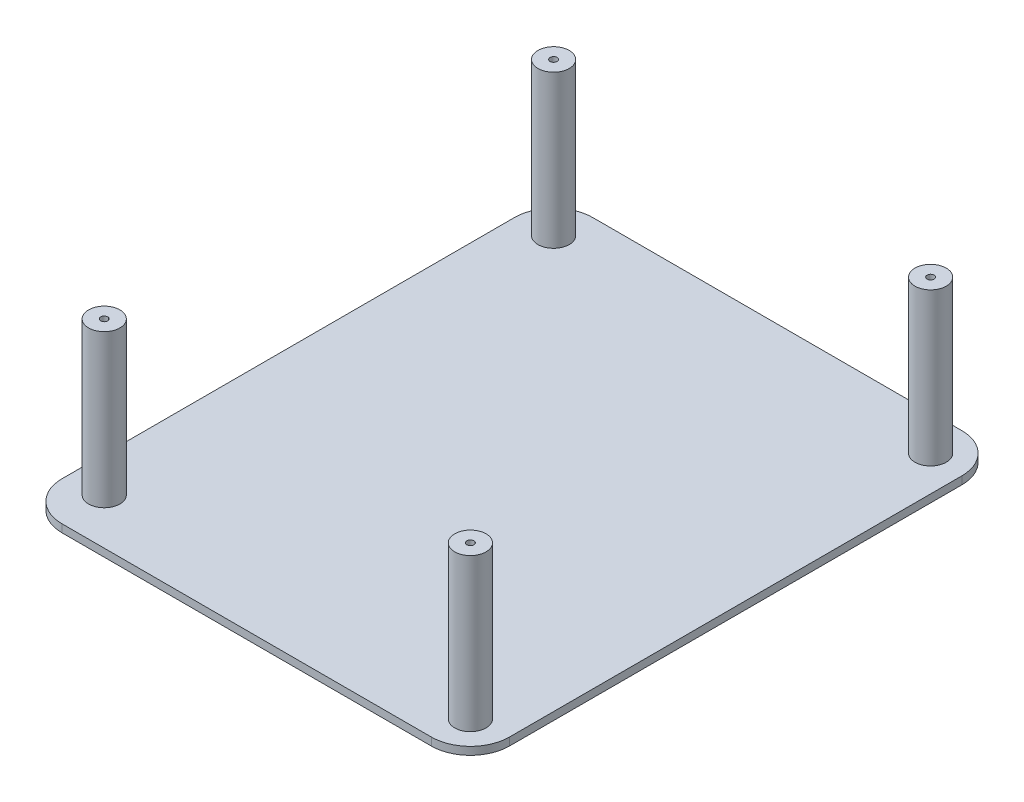
ISO-10303-21;
HEADER;
FILE_DESCRIPTION(('STEP AP214'),'2;1');
FILE_NAME('part.step','',(''),(''),'','','');
FILE_SCHEMA(('AUTOMOTIVE_DESIGN { 1 0 10303 214 1 1 1 1 }'));
ENDSEC;
DATA;
#1=APPLICATION_CONTEXT('core data for automotive mechanical design processes');
#2=APPLICATION_PROTOCOL_DEFINITION('international standard','automotive_design',2000,#1);
#3=PRODUCT_CONTEXT('',#1,'mechanical');
#4=PRODUCT('Part','Part','',(#3));
#5=PRODUCT_RELATED_PRODUCT_CATEGORY('part','',(#4));
#6=PRODUCT_DEFINITION_FORMATION('','',#4);
#7=PRODUCT_DEFINITION_CONTEXT('part definition',#1,'design');
#8=PRODUCT_DEFINITION('design','',#6,#7);
#9=PRODUCT_DEFINITION_SHAPE('','',#8);
#10=(LENGTH_UNIT() NAMED_UNIT(*) SI_UNIT(.MILLI.,.METRE.));
#11=(NAMED_UNIT(*) PLANE_ANGLE_UNIT() SI_UNIT($,.RADIAN.));
#12=(NAMED_UNIT(*) SI_UNIT($,.STERADIAN.) SOLID_ANGLE_UNIT());
#13=UNCERTAINTY_MEASURE_WITH_UNIT(LENGTH_MEASURE(1.E-05),#10,'distance_accuracy_value','');
#14=(GEOMETRIC_REPRESENTATION_CONTEXT(3) GLOBAL_UNCERTAINTY_ASSIGNED_CONTEXT((#13)) GLOBAL_UNIT_ASSIGNED_CONTEXT((#10,
#11,#12)) REPRESENTATION_CONTEXT('',''));
#15=CARTESIAN_POINT('',(0.,0.,0.));
#16=DIRECTION('',(0.,0.,1.));
#17=DIRECTION('',(1.,0.,0.));
#18=AXIS2_PLACEMENT_3D('',#15,#16,#17);
#19=CARTESIAN_POINT('',(-57.434954554311,2.,-52.5896188820338));
#20=DIRECTION('',(1.,0.,0.));
#21=DIRECTION('',(0.,0.,-1.));
#22=AXIS2_PLACEMENT_3D('',#19,#20,#21);
#23=PLANE('',#22);
#24=DIRECTION('',(0.,0.,1.));
#25=VECTOR('',#24,1.);
#26=CARTESIAN_POINT('',(-57.434954554311,0.,-52.5896188820338));
#27=LINE('',#26,#25);
#28=CARTESIAN_POINT('',(-57.434954554311,0.,-42.5896188820338));
#29=VERTEX_POINT('',#28);
#30=CARTESIAN_POINT('',(-57.434954554311,0.,73.0797799417298));
#31=VERTEX_POINT('',#30);
#32=EDGE_CURVE('E136',#29,#31,#27,.T.);
#33=ORIENTED_EDGE('',*,*,#32,.T.);
#34=DIRECTION('',(0.,-1.,0.));
#35=VECTOR('',#34,1.);
#36=CARTESIAN_POINT('',(-57.434954554311,2.,73.0797799417298));
#37=LINE('',#36,#35);
#38=CARTESIAN_POINT('',(-57.434954554311,2.,73.0797799417298));
#39=VERTEX_POINT('',#38);
#40=EDGE_CURVE('E111',#31,#39,#37,.F.);
#41=ORIENTED_EDGE('',*,*,#40,.T.);
#42=DIRECTION('',(0.,0.,1.));
#43=VECTOR('',#42,1.);
#44=CARTESIAN_POINT('',(-57.434954554311,2.,-52.5896188820338));
#45=LINE('',#44,#43);
#46=CARTESIAN_POINT('',(-57.434954554311,2.,-42.5896188820338));
#47=VERTEX_POINT('',#46);
#48=EDGE_CURVE('E149',#47,#39,#45,.T.);
#49=ORIENTED_EDGE('',*,*,#48,.F.);
#50=DIRECTION('',(0.,-1.,0.));
#51=VECTOR('',#50,1.);
#52=CARTESIAN_POINT('',(-57.434954554311,2.,-42.5896188820338));
#53=LINE('',#52,#51);
#54=EDGE_CURVE('E117',#47,#29,#53,.T.);
#55=ORIENTED_EDGE('',*,*,#54,.T.);
#56=EDGE_LOOP('',(#33,#41,#49,#55));
#57=FACE_BOUND('',#56,.T.);
#58=ADVANCED_FACE('F39',(#57),#23,.F.);
#59=CARTESIAN_POINT('',(-57.434954554311,2.,83.0797799417298));
#60=DIRECTION('',(0.,0.,-1.));
#61=DIRECTION('',(-1.,0.,0.));
#62=AXIS2_PLACEMENT_3D('',#59,#60,#61);
#63=PLANE('',#62);
#64=DIRECTION('',(1.,0.,0.));
#65=VECTOR('',#64,1.);
#66=CARTESIAN_POINT('',(-57.434954554311,2.,83.0797799417298));
#67=LINE('',#66,#65);
#68=CARTESIAN_POINT('',(-47.434954554311,2.,83.0797799417298));
#69=VERTEX_POINT('',#68);
#70=CARTESIAN_POINT('',(46.9622388789669,2.,83.0797799417298));
#71=VERTEX_POINT('',#70);
#72=EDGE_CURVE('E127',#69,#71,#67,.T.);
#73=ORIENTED_EDGE('',*,*,#72,.F.);
#74=DIRECTION('',(0.,-1.,0.));
#75=VECTOR('',#74,1.);
#76=CARTESIAN_POINT('',(-47.434954554311,2.,83.0797799417298));
#77=LINE('',#76,#75);
#78=CARTESIAN_POINT('',(-47.434954554311,0.,83.0797799417298));
#79=VERTEX_POINT('',#78);
#80=EDGE_CURVE('E110',#69,#79,#77,.T.);
#81=ORIENTED_EDGE('',*,*,#80,.T.);
#82=DIRECTION('',(1.,0.,0.));
#83=VECTOR('',#82,1.);
#84=CARTESIAN_POINT('',(-57.434954554311,0.,83.0797799417298));
#85=LINE('',#84,#83);
#86=CARTESIAN_POINT('',(46.9622388789669,0.,83.0797799417298));
#87=VERTEX_POINT('',#86);
#88=EDGE_CURVE('E124',#79,#87,#85,.T.);
#89=ORIENTED_EDGE('',*,*,#88,.T.);
#90=DIRECTION('',(0.,-1.,0.));
#91=VECTOR('',#90,1.);
#92=CARTESIAN_POINT('',(46.9622388789669,2.,83.0797799417298));
#93=LINE('',#92,#91);
#94=EDGE_CURVE('E130',#87,#71,#93,.F.);
#95=ORIENTED_EDGE('',*,*,#94,.T.);
#96=EDGE_LOOP('',(#73,#81,#89,#95));
#97=FACE_BOUND('',#96,.T.);
#98=ADVANCED_FACE('F123',(#97),#63,.F.);
#99=CARTESIAN_POINT('',(56.962238878967,2.,-52.5896188820338));
#100=DIRECTION('',(-1.,0.,0.));
#101=DIRECTION('',(0.,0.,1.));
#102=AXIS2_PLACEMENT_3D('',#99,#100,#101);
#103=PLANE('',#102);
#104=DIRECTION('',(0.,0.,-1.));
#105=VECTOR('',#104,1.);
#106=CARTESIAN_POINT('',(56.962238878967,0.,-52.5896188820338));
#107=LINE('',#106,#105);
#108=CARTESIAN_POINT('',(56.962238878967,0.,73.0797799417298));
#109=VERTEX_POINT('',#108);
#110=CARTESIAN_POINT('',(56.962238878967,0.,-42.5896188820338));
#111=VERTEX_POINT('',#110);
#112=EDGE_CURVE('E135',#109,#111,#107,.T.);
#113=ORIENTED_EDGE('',*,*,#112,.T.);
#114=DIRECTION('',(0.,-1.,0.));
#115=VECTOR('',#114,1.);
#116=CARTESIAN_POINT('',(56.962238878967,2.,-42.5896188820338));
#117=LINE('',#116,#115);
#118=CARTESIAN_POINT('',(56.962238878967,2.,-42.5896188820338));
#119=VERTEX_POINT('',#118);
#120=EDGE_CURVE('E11',#111,#119,#117,.F.);
#121=ORIENTED_EDGE('',*,*,#120,.T.);
#122=DIRECTION('',(0.,0.,-1.));
#123=VECTOR('',#122,1.);
#124=CARTESIAN_POINT('',(56.962238878967,2.,-52.5896188820338));
#125=LINE('',#124,#123);
#126=CARTESIAN_POINT('',(56.962238878967,2.,73.0797799417298));
#127=VERTEX_POINT('',#126);
#128=EDGE_CURVE('E188',#127,#119,#125,.T.);
#129=ORIENTED_EDGE('',*,*,#128,.F.);
#130=DIRECTION('',(0.,-1.,0.));
#131=VECTOR('',#130,1.);
#132=CARTESIAN_POINT('',(56.962238878967,2.,73.0797799417298));
#133=LINE('',#132,#131);
#134=EDGE_CURVE('E48',#127,#109,#133,.T.);
#135=ORIENTED_EDGE('',*,*,#134,.T.);
#136=EDGE_LOOP('',(#113,#121,#129,#135));
#137=FACE_BOUND('',#136,.T.);
#138=ADVANCED_FACE('F186',(#137),#103,.F.);
#139=CARTESIAN_POINT('',(-57.434954554311,2.,-52.5896188820338));
#140=DIRECTION('',(0.,0.,1.));
#141=DIRECTION('',(1.,0.,0.));
#142=AXIS2_PLACEMENT_3D('',#139,#140,#141);
#143=PLANE('',#142);
#144=DIRECTION('',(-1.,0.,0.));
#145=VECTOR('',#144,1.);
#146=CARTESIAN_POINT('',(-57.434954554311,0.,-52.5896188820338));
#147=LINE('',#146,#145);
#148=CARTESIAN_POINT('',(46.9622388789669,0.,-52.5896188820338));
#149=VERTEX_POINT('',#148);
#150=CARTESIAN_POINT('',(-47.434954554311,0.,-52.5896188820338));
#151=VERTEX_POINT('',#150);
#152=EDGE_CURVE('E141',#149,#151,#147,.T.);
#153=ORIENTED_EDGE('',*,*,#152,.T.);
#154=DIRECTION('',(0.,-1.,0.));
#155=VECTOR('',#154,1.);
#156=CARTESIAN_POINT('',(-47.434954554311,2.,-52.5896188820338));
#157=LINE('',#156,#155);
#158=CARTESIAN_POINT('',(-47.434954554311,2.,-52.5896188820338));
#159=VERTEX_POINT('',#158);
#160=EDGE_CURVE('E55',#151,#159,#157,.F.);
#161=ORIENTED_EDGE('',*,*,#160,.T.);
#162=DIRECTION('',(-1.,0.,0.));
#163=VECTOR('',#162,1.);
#164=CARTESIAN_POINT('',(-57.434954554311,2.,-52.5896188820338));
#165=LINE('',#164,#163);
#166=CARTESIAN_POINT('',(46.9622388789669,2.,-52.5896188820338));
#167=VERTEX_POINT('',#166);
#168=EDGE_CURVE('E151',#167,#159,#165,.T.);
#169=ORIENTED_EDGE('',*,*,#168,.F.);
#170=DIRECTION('',(0.,-1.,0.));
#171=VECTOR('',#170,1.);
#172=CARTESIAN_POINT('',(46.9622388789669,2.,-52.5896188820338));
#173=LINE('',#172,#171);
#174=EDGE_CURVE('E176',#167,#149,#173,.T.);
#175=ORIENTED_EDGE('',*,*,#174,.T.);
#176=EDGE_LOOP('',(#153,#161,#169,#175));
#177=FACE_BOUND('',#176,.T.);
#178=ADVANCED_FACE('F195',(#177),#143,.F.);
#179=CARTESIAN_POINT('',(0.,2.,0.));
#180=DIRECTION('',(0.,1.,0.));
#181=DIRECTION('',(0.,0.,1.));
#182=AXIS2_PLACEMENT_3D('',#179,#180,#181);
#183=PLANE('',#182);
#184=CARTESIAN_POINT('',(-48.434954554311,2.,71.3067083737258));
#185=DIRECTION('',(0.,1.,0.));
#186=DIRECTION('',(0.,0.,1.));
#187=AXIS2_PLACEMENT_3D('',#184,#185,#186);
#188=CIRCLE('',#187,4.00000000000001);
#189=CARTESIAN_POINT('',(-48.434954554311,2.,75.3067083737258));
#190=VERTEX_POINT('',#189);
#191=EDGE_CURVE('E230',#190,#190,#188,.T.);
#192=ORIENTED_EDGE('',*,*,#191,.F.);
#193=EDGE_LOOP('',(#192));
#194=FACE_BOUND('',#193,.T.);
#195=CARTESIAN_POINT('',(47.9622388789669,2.,74.0797799417298));
#196=DIRECTION('',(0.,1.,0.));
#197=DIRECTION('',(0.,0.,1.));
#198=AXIS2_PLACEMENT_3D('',#195,#196,#197);
#199=CIRCLE('',#198,4.00000000000001);
#200=CARTESIAN_POINT('',(47.9622388789669,2.,78.0797799417298));
#201=VERTEX_POINT('',#200);
#202=EDGE_CURVE('E222',#201,#201,#199,.T.);
#203=ORIENTED_EDGE('',*,*,#202,.F.);
#204=EDGE_LOOP('',(#203));
#205=FACE_BOUND('',#204,.T.);
#206=CARTESIAN_POINT('',(47.962238878967,2.,-43.5896188820338));
#207=DIRECTION('',(0.,1.,0.));
#208=DIRECTION('',(0.,0.,1.));
#209=AXIS2_PLACEMENT_3D('',#206,#207,#208);
#210=CIRCLE('',#209,4.00000000000001);
#211=CARTESIAN_POINT('',(47.962238878967,2.,-39.5896188820338));
#212=VERTEX_POINT('',#211);
#213=EDGE_CURVE('E214',#212,#212,#210,.T.);
#214=ORIENTED_EDGE('',*,*,#213,.F.);
#215=EDGE_LOOP('',(#214));
#216=FACE_BOUND('',#215,.T.);
#217=CARTESIAN_POINT('',(-48.434954554311,2.,-43.5896188820338));
#218=DIRECTION('',(0.,1.,0.));
#219=DIRECTION('',(0.,0.,1.));
#220=AXIS2_PLACEMENT_3D('',#217,#218,#219);
#221=CIRCLE('',#220,4.00000000000001);
#222=CARTESIAN_POINT('',(-48.434954554311,2.,-39.5896188820337));
#223=VERTEX_POINT('',#222);
#224=EDGE_CURVE('E206',#223,#223,#221,.T.);
#225=ORIENTED_EDGE('',*,*,#224,.F.);
#226=EDGE_LOOP('',(#225));
#227=FACE_BOUND('',#226,.T.);
#228=ORIENTED_EDGE('',*,*,#48,.T.);
#229=CARTESIAN_POINT('',(-47.434954554311,2.,73.0797799417298));
#230=DIRECTION('',(0.,1.,0.));
#231=DIRECTION('',(0.,0.,1.));
#232=AXIS2_PLACEMENT_3D('',#229,#230,#231);
#233=CIRCLE('',#232,10.);
#234=EDGE_CURVE('E173',#39,#69,#233,.T.);
#235=ORIENTED_EDGE('',*,*,#234,.T.);
#236=ORIENTED_EDGE('',*,*,#72,.T.);
#237=CARTESIAN_POINT('',(46.962238878967,2.,73.0797799417298));
#238=DIRECTION('',(0.,1.,0.));
#239=DIRECTION('',(0.,0.,1.));
#240=AXIS2_PLACEMENT_3D('',#237,#238,#239);
#241=CIRCLE('',#240,10.);
#242=EDGE_CURVE('E165',#71,#127,#241,.T.);
#243=ORIENTED_EDGE('',*,*,#242,.T.);
#244=ORIENTED_EDGE('',*,*,#128,.T.);
#245=CARTESIAN_POINT('',(46.9622388789669,2.,-42.5896188820338));
#246=DIRECTION('',(0.,1.,0.));
#247=DIRECTION('',(0.,0.,1.));
#248=AXIS2_PLACEMENT_3D('',#245,#246,#247);
#249=CIRCLE('',#248,10.);
#250=EDGE_CURVE('E62',#119,#167,#249,.T.);
#251=ORIENTED_EDGE('',*,*,#250,.T.);
#252=ORIENTED_EDGE('',*,*,#168,.T.);
#253=CARTESIAN_POINT('',(-47.434954554311,2.,-42.5896188820338));
#254=DIRECTION('',(0.,1.,0.));
#255=DIRECTION('',(0.,0.,1.));
#256=AXIS2_PLACEMENT_3D('',#253,#254,#255);
#257=CIRCLE('',#256,10.);
#258=EDGE_CURVE('E170',#159,#47,#257,.T.);
#259=ORIENTED_EDGE('',*,*,#258,.T.);
#260=EDGE_LOOP('',(#228,#235,#236,#243,#244,#251,#252,#259));
#261=FACE_BOUND('',#260,.T.);
#262=ADVANCED_FACE('F293',(#194,#205,#216,#227,#261),#183,.T.);
#263=CARTESIAN_POINT('',(0.,0.,0.));
#264=DIRECTION('',(0.,1.,0.));
#265=DIRECTION('',(0.,0.,1.));
#266=AXIS2_PLACEMENT_3D('',#263,#264,#265);
#267=PLANE('',#266);
#268=ORIENTED_EDGE('',*,*,#88,.F.);
#269=CARTESIAN_POINT('',(-47.434954554311,0.,73.0797799417298));
#270=DIRECTION('',(0.,1.,0.));
#271=DIRECTION('',(0.,0.,1.));
#272=AXIS2_PLACEMENT_3D('',#269,#270,#271);
#273=CIRCLE('',#272,10.);
#274=EDGE_CURVE('E106',#79,#31,#273,.F.);
#275=ORIENTED_EDGE('',*,*,#274,.T.);
#276=ORIENTED_EDGE('',*,*,#32,.F.);
#277=CARTESIAN_POINT('',(-47.434954554311,0.,-42.5896188820338));
#278=DIRECTION('',(0.,1.,0.));
#279=DIRECTION('',(0.,0.,1.));
#280=AXIS2_PLACEMENT_3D('',#277,#278,#279);
#281=CIRCLE('',#280,10.);
#282=EDGE_CURVE('E118',#29,#151,#281,.F.);
#283=ORIENTED_EDGE('',*,*,#282,.T.);
#284=ORIENTED_EDGE('',*,*,#152,.F.);
#285=CARTESIAN_POINT('',(46.9622388789669,0.,-42.5896188820338));
#286=DIRECTION('',(0.,1.,0.));
#287=DIRECTION('',(0.,0.,1.));
#288=AXIS2_PLACEMENT_3D('',#285,#286,#287);
#289=CIRCLE('',#288,10.);
#290=EDGE_CURVE('E155',#149,#111,#289,.F.);
#291=ORIENTED_EDGE('',*,*,#290,.T.);
#292=ORIENTED_EDGE('',*,*,#112,.F.);
#293=CARTESIAN_POINT('',(46.962238878967,0.,73.0797799417298));
#294=DIRECTION('',(0.,1.,0.));
#295=DIRECTION('',(0.,0.,1.));
#296=AXIS2_PLACEMENT_3D('',#293,#294,#295);
#297=CIRCLE('',#296,10.);
#298=EDGE_CURVE('E129',#109,#87,#297,.F.);
#299=ORIENTED_EDGE('',*,*,#298,.T.);
#300=EDGE_LOOP('',(#268,#275,#276,#283,#284,#291,#292,#299));
#301=FACE_BOUND('',#300,.T.);
#302=ADVANCED_FACE('F132',(#301),#267,.F.);
#303=CARTESIAN_POINT('',(-48.434954554311,41.,-43.5896188820338));
#304=DIRECTION('',(0.,-1.,0.));
#305=DIRECTION('',(0.,0.,-1.));
#306=AXIS2_PLACEMENT_3D('',#303,#304,#305);
#307=CYLINDRICAL_SURFACE('',#306,4.00000000000001);
#308=CARTESIAN_POINT('',(-48.434954554311,41.,-43.5896188820338));
#309=DIRECTION('',(0.,1.,0.));
#310=DIRECTION('',(0.,0.,1.));
#311=AXIS2_PLACEMENT_3D('',#308,#309,#310);
#312=CIRCLE('',#311,4.00000000000001);
#313=CARTESIAN_POINT('',(-48.434954554311,41.,-39.5896188820337));
#314=VERTEX_POINT('',#313);
#315=EDGE_CURVE('E143',#314,#314,#312,.T.);
#316=ORIENTED_EDGE('',*,*,#315,.F.);
#317=EDGE_LOOP('',(#316));
#318=FACE_BOUND('',#317,.T.);
#319=ORIENTED_EDGE('',*,*,#224,.T.);
#320=EDGE_LOOP('',(#319));
#321=FACE_BOUND('',#320,.T.);
#322=ADVANCED_FACE('F326',(#318,#321),#307,.T.);
#323=CARTESIAN_POINT('',(-48.434954554311,41.,-43.5896188820338));
#324=DIRECTION('',(0.,1.,0.));
#325=DIRECTION('',(0.,0.,1.));
#326=AXIS2_PLACEMENT_3D('',#323,#324,#325);
#327=PLANE('',#326);
#328=CARTESIAN_POINT('',(-48.434954554311,41.,-43.5896188820338));
#329=DIRECTION('',(0.,1.,0.));
#330=DIRECTION('',(0.,0.,1.));
#331=AXIS2_PLACEMENT_3D('',#328,#329,#330);
#332=CIRCLE('',#331,0.899999999999996);
#333=CARTESIAN_POINT('',(-48.434954554311,41.,-42.6896188820338));
#334=VERTEX_POINT('',#333);
#335=EDGE_CURVE('E246',#334,#334,#332,.T.);
#336=ORIENTED_EDGE('',*,*,#335,.F.);
#337=EDGE_LOOP('',(#336));
#338=FACE_BOUND('',#337,.T.);
#339=ORIENTED_EDGE('',*,*,#315,.T.);
#340=EDGE_LOOP('',(#339));
#341=FACE_BOUND('',#340,.T.);
#342=ADVANCED_FACE('F330',(#338,#341),#327,.T.);
#343=CARTESIAN_POINT('',(47.962238878967,41.,-43.5896188820338));
#344=DIRECTION('',(0.,-1.,0.));
#345=DIRECTION('',(0.,0.,-1.));
#346=AXIS2_PLACEMENT_3D('',#343,#344,#345);
#347=CYLINDRICAL_SURFACE('',#346,4.00000000000001);
#348=CARTESIAN_POINT('',(47.962238878967,41.,-43.5896188820338));
#349=DIRECTION('',(0.,1.,0.));
#350=DIRECTION('',(0.,0.,1.));
#351=AXIS2_PLACEMENT_3D('',#348,#349,#350);
#352=CIRCLE('',#351,4.00000000000001);
#353=CARTESIAN_POINT('',(47.962238878967,41.,-39.5896188820338));
#354=VERTEX_POINT('',#353);
#355=EDGE_CURVE('E210',#354,#354,#352,.T.);
#356=ORIENTED_EDGE('',*,*,#355,.F.);
#357=EDGE_LOOP('',(#356));
#358=FACE_BOUND('',#357,.T.);
#359=ORIENTED_EDGE('',*,*,#213,.T.);
#360=EDGE_LOOP('',(#359));
#361=FACE_BOUND('',#360,.T.);
#362=ADVANCED_FACE('F334',(#358,#361),#347,.T.);
#363=CARTESIAN_POINT('',(47.962238878967,41.,-43.5896188820338));
#364=DIRECTION('',(0.,1.,0.));
#365=DIRECTION('',(0.,0.,1.));
#366=AXIS2_PLACEMENT_3D('',#363,#364,#365);
#367=PLANE('',#366);
#368=CARTESIAN_POINT('',(47.962238878967,41.,-43.5896188820338));
#369=DIRECTION('',(0.,1.,0.));
#370=DIRECTION('',(0.,0.,1.));
#371=AXIS2_PLACEMENT_3D('',#368,#369,#370);
#372=CIRCLE('',#371,0.899999999999996);
#373=CARTESIAN_POINT('',(47.962238878967,41.,-42.6896188820338));
#374=VERTEX_POINT('',#373);
#375=EDGE_CURVE('E238',#374,#374,#372,.T.);
#376=ORIENTED_EDGE('',*,*,#375,.F.);
#377=EDGE_LOOP('',(#376));
#378=FACE_BOUND('',#377,.T.);
#379=ORIENTED_EDGE('',*,*,#355,.T.);
#380=EDGE_LOOP('',(#379));
#381=FACE_BOUND('',#380,.T.);
#382=ADVANCED_FACE('F289',(#378,#381),#367,.T.);
#383=CARTESIAN_POINT('',(47.9622388789669,41.,74.0797799417298));
#384=DIRECTION('',(0.,-1.,0.));
#385=DIRECTION('',(0.,0.,-1.));
#386=AXIS2_PLACEMENT_3D('',#383,#384,#385);
#387=CYLINDRICAL_SURFACE('',#386,4.00000000000001);
#388=CARTESIAN_POINT('',(47.9622388789669,41.,74.0797799417298));
#389=DIRECTION('',(0.,1.,0.));
#390=DIRECTION('',(0.,0.,1.));
#391=AXIS2_PLACEMENT_3D('',#388,#389,#390);
#392=CIRCLE('',#391,4.00000000000001);
#393=CARTESIAN_POINT('',(47.9622388789669,41.,78.0797799417298));
#394=VERTEX_POINT('',#393);
#395=EDGE_CURVE('E218',#394,#394,#392,.T.);
#396=ORIENTED_EDGE('',*,*,#395,.F.);
#397=EDGE_LOOP('',(#396));
#398=FACE_BOUND('',#397,.T.);
#399=ORIENTED_EDGE('',*,*,#202,.T.);
#400=EDGE_LOOP('',(#399));
#401=FACE_BOUND('',#400,.T.);
#402=ADVANCED_FACE('F283',(#398,#401),#387,.T.);
#403=CARTESIAN_POINT('',(47.9622388789669,41.,74.0797799417298));
#404=DIRECTION('',(0.,1.,0.));
#405=DIRECTION('',(0.,0.,1.));
#406=AXIS2_PLACEMENT_3D('',#403,#404,#405);
#407=PLANE('',#406);
#408=CARTESIAN_POINT('',(47.9622388789669,41.,74.0797799417298));
#409=DIRECTION('',(0.,1.,0.));
#410=DIRECTION('',(0.,0.,1.));
#411=AXIS2_PLACEMENT_3D('',#408,#409,#410);
#412=CIRCLE('',#411,0.899999999999996);
#413=CARTESIAN_POINT('',(47.9622388789669,41.,74.9797799417298));
#414=VERTEX_POINT('',#413);
#415=EDGE_CURVE('E262',#414,#414,#412,.T.);
#416=ORIENTED_EDGE('',*,*,#415,.F.);
#417=EDGE_LOOP('',(#416));
#418=FACE_BOUND('',#417,.T.);
#419=ORIENTED_EDGE('',*,*,#395,.T.);
#420=EDGE_LOOP('',(#419));
#421=FACE_BOUND('',#420,.T.);
#422=ADVANCED_FACE('F279',(#418,#421),#407,.T.);
#423=CARTESIAN_POINT('',(-48.434954554311,41.,71.3067083737258));
#424=DIRECTION('',(0.,-1.,0.));
#425=DIRECTION('',(0.,0.,-1.));
#426=AXIS2_PLACEMENT_3D('',#423,#424,#425);
#427=CYLINDRICAL_SURFACE('',#426,4.00000000000001);
#428=CARTESIAN_POINT('',(-48.434954554311,41.,71.3067083737258));
#429=DIRECTION('',(0.,1.,0.));
#430=DIRECTION('',(0.,0.,1.));
#431=AXIS2_PLACEMENT_3D('',#428,#429,#430);
#432=CIRCLE('',#431,4.00000000000001);
#433=CARTESIAN_POINT('',(-48.434954554311,41.,75.3067083737258));
#434=VERTEX_POINT('',#433);
#435=EDGE_CURVE('E226',#434,#434,#432,.T.);
#436=ORIENTED_EDGE('',*,*,#435,.F.);
#437=EDGE_LOOP('',(#436));
#438=FACE_BOUND('',#437,.T.);
#439=ORIENTED_EDGE('',*,*,#191,.T.);
#440=EDGE_LOOP('',(#439));
#441=FACE_BOUND('',#440,.T.);
#442=ADVANCED_FACE('F282',(#438,#441),#427,.T.);
#443=CARTESIAN_POINT('',(-48.434954554311,41.,71.3067083737258));
#444=DIRECTION('',(0.,1.,0.));
#445=DIRECTION('',(0.,0.,1.));
#446=AXIS2_PLACEMENT_3D('',#443,#444,#445);
#447=PLANE('',#446);
#448=CARTESIAN_POINT('',(-48.434954554311,41.,71.3067083737258));
#449=DIRECTION('',(0.,1.,0.));
#450=DIRECTION('',(0.,0.,1.));
#451=AXIS2_PLACEMENT_3D('',#448,#449,#450);
#452=CIRCLE('',#451,0.899999999999996);
#453=CARTESIAN_POINT('',(-48.434954554311,41.,72.2067083737258));
#454=VERTEX_POINT('',#453);
#455=EDGE_CURVE('E254',#454,#454,#452,.T.);
#456=ORIENTED_EDGE('',*,*,#455,.F.);
#457=EDGE_LOOP('',(#456));
#458=FACE_BOUND('',#457,.T.);
#459=ORIENTED_EDGE('',*,*,#435,.T.);
#460=EDGE_LOOP('',(#459));
#461=FACE_BOUND('',#460,.T.);
#462=ADVANCED_FACE('F344',(#458,#461),#447,.T.);
#463=CARTESIAN_POINT('',(-48.434954554311,30.,71.3067083737258));
#464=DIRECTION('',(0.,1.,0.));
#465=DIRECTION('',(0.,0.,1.));
#466=AXIS2_PLACEMENT_3D('',#463,#464,#465);
#467=CYLINDRICAL_SURFACE('',#466,0.899999999999996);
#468=CARTESIAN_POINT('',(-48.434954554311,30.,71.3067083737258));
#469=DIRECTION('',(0.,1.,0.));
#470=DIRECTION('',(0.,0.,1.));
#471=AXIS2_PLACEMENT_3D('',#468,#469,#470);
#472=CIRCLE('',#471,0.899999999999996);
#473=CARTESIAN_POINT('',(-48.434954554311,30.,72.2067083737258));
#474=VERTEX_POINT('',#473);
#475=EDGE_CURVE('E258',#474,#474,#472,.T.);
#476=ORIENTED_EDGE('',*,*,#475,.F.);
#477=EDGE_LOOP('',(#476));
#478=FACE_BOUND('',#477,.T.);
#479=ORIENTED_EDGE('',*,*,#455,.T.);
#480=EDGE_LOOP('',(#479));
#481=FACE_BOUND('',#480,.T.);
#482=ADVANCED_FACE('F348',(#478,#481),#467,.F.);
#483=CARTESIAN_POINT('',(-48.434954554311,30.,71.3067083737258));
#484=DIRECTION('',(0.,1.,0.));
#485=DIRECTION('',(0.,0.,1.));
#486=AXIS2_PLACEMENT_3D('',#483,#484,#485);
#487=PLANE('',#486);
#488=ORIENTED_EDGE('',*,*,#475,.T.);
#489=EDGE_LOOP('',(#488));
#490=FACE_BOUND('',#489,.T.);
#491=ADVANCED_FACE('F275',(#490),#487,.T.);
#492=CARTESIAN_POINT('',(47.9622388789669,30.,74.0797799417298));
#493=DIRECTION('',(0.,1.,0.));
#494=DIRECTION('',(0.,0.,1.));
#495=AXIS2_PLACEMENT_3D('',#492,#493,#494);
#496=CYLINDRICAL_SURFACE('',#495,0.899999999999996);
#497=CARTESIAN_POINT('',(47.9622388789669,30.,74.0797799417298));
#498=DIRECTION('',(0.,1.,0.));
#499=DIRECTION('',(0.,0.,1.));
#500=AXIS2_PLACEMENT_3D('',#497,#498,#499);
#501=CIRCLE('',#500,0.899999999999996);
#502=CARTESIAN_POINT('',(47.9622388789669,30.,74.9797799417298));
#503=VERTEX_POINT('',#502);
#504=EDGE_CURVE('E234',#503,#503,#501,.T.);
#505=ORIENTED_EDGE('',*,*,#504,.F.);
#506=EDGE_LOOP('',(#505));
#507=FACE_BOUND('',#506,.T.);
#508=ORIENTED_EDGE('',*,*,#415,.T.);
#509=EDGE_LOOP('',(#508));
#510=FACE_BOUND('',#509,.T.);
#511=ADVANCED_FACE('F272',(#507,#510),#496,.F.);
#512=CARTESIAN_POINT('',(47.9622388789669,30.,74.0797799417298));
#513=DIRECTION('',(0.,1.,0.));
#514=DIRECTION('',(0.,0.,1.));
#515=AXIS2_PLACEMENT_3D('',#512,#513,#514);
#516=PLANE('',#515);
#517=ORIENTED_EDGE('',*,*,#504,.T.);
#518=EDGE_LOOP('',(#517));
#519=FACE_BOUND('',#518,.T.);
#520=ADVANCED_FACE('F270',(#519),#516,.T.);
#521=CARTESIAN_POINT('',(47.962238878967,30.,-43.5896188820338));
#522=DIRECTION('',(0.,1.,0.));
#523=DIRECTION('',(0.,0.,1.));
#524=AXIS2_PLACEMENT_3D('',#521,#522,#523);
#525=CYLINDRICAL_SURFACE('',#524,0.899999999999996);
#526=CARTESIAN_POINT('',(47.962238878967,30.,-43.5896188820338));
#527=DIRECTION('',(0.,1.,0.));
#528=DIRECTION('',(0.,0.,1.));
#529=AXIS2_PLACEMENT_3D('',#526,#527,#528);
#530=CIRCLE('',#529,0.899999999999996);
#531=CARTESIAN_POINT('',(47.962238878967,30.,-42.6896188820338));
#532=VERTEX_POINT('',#531);
#533=EDGE_CURVE('E242',#532,#532,#530,.T.);
#534=ORIENTED_EDGE('',*,*,#533,.F.);
#535=EDGE_LOOP('',(#534));
#536=FACE_BOUND('',#535,.T.);
#537=ORIENTED_EDGE('',*,*,#375,.T.);
#538=EDGE_LOOP('',(#537));
#539=FACE_BOUND('',#538,.T.);
#540=ADVANCED_FACE('F350',(#536,#539),#525,.F.);
#541=CARTESIAN_POINT('',(47.962238878967,30.,-43.5896188820338));
#542=DIRECTION('',(0.,1.,0.));
#543=DIRECTION('',(0.,0.,1.));
#544=AXIS2_PLACEMENT_3D('',#541,#542,#543);
#545=PLANE('',#544);
#546=ORIENTED_EDGE('',*,*,#533,.T.);
#547=EDGE_LOOP('',(#546));
#548=FACE_BOUND('',#547,.T.);
#549=ADVANCED_FACE('F353',(#548),#545,.T.);
#550=CARTESIAN_POINT('',(-48.434954554311,30.,-43.5896188820338));
#551=DIRECTION('',(0.,1.,0.));
#552=DIRECTION('',(0.,0.,1.));
#553=AXIS2_PLACEMENT_3D('',#550,#551,#552);
#554=CYLINDRICAL_SURFACE('',#553,0.899999999999996);
#555=CARTESIAN_POINT('',(-48.434954554311,30.,-43.5896188820338));
#556=DIRECTION('',(0.,1.,0.));
#557=DIRECTION('',(0.,0.,1.));
#558=AXIS2_PLACEMENT_3D('',#555,#556,#557);
#559=CIRCLE('',#558,0.899999999999996);
#560=CARTESIAN_POINT('',(-48.434954554311,30.,-42.6896188820338));
#561=VERTEX_POINT('',#560);
#562=EDGE_CURVE('E250',#561,#561,#559,.T.);
#563=ORIENTED_EDGE('',*,*,#562,.F.);
#564=EDGE_LOOP('',(#563));
#565=FACE_BOUND('',#564,.T.);
#566=ORIENTED_EDGE('',*,*,#335,.T.);
#567=EDGE_LOOP('',(#566));
#568=FACE_BOUND('',#567,.T.);
#569=ADVANCED_FACE('F357',(#565,#568),#554,.F.);
#570=CARTESIAN_POINT('',(-48.434954554311,30.,-43.5896188820338));
#571=DIRECTION('',(0.,1.,0.));
#572=DIRECTION('',(0.,0.,1.));
#573=AXIS2_PLACEMENT_3D('',#570,#571,#572);
#574=PLANE('',#573);
#575=ORIENTED_EDGE('',*,*,#562,.T.);
#576=EDGE_LOOP('',(#575));
#577=FACE_BOUND('',#576,.T.);
#578=ADVANCED_FACE('F312',(#577),#574,.T.);
#579=CARTESIAN_POINT('',(-47.434954554311,2.,73.0797799417298));
#580=DIRECTION('',(0.,-1.,0.));
#581=DIRECTION('',(0.,0.,-1.));
#582=AXIS2_PLACEMENT_3D('',#579,#580,#581);
#583=CYLINDRICAL_SURFACE('',#582,10.);
#584=ORIENTED_EDGE('',*,*,#234,.F.);
#585=ORIENTED_EDGE('',*,*,#40,.F.);
#586=ORIENTED_EDGE('',*,*,#274,.F.);
#587=ORIENTED_EDGE('',*,*,#80,.F.);
#588=EDGE_LOOP('',(#584,#585,#586,#587));
#589=FACE_BOUND('',#588,.T.);
#590=ADVANCED_FACE('F109',(#589),#583,.T.);
#591=CARTESIAN_POINT('',(-47.434954554311,2.,-42.5896188820338));
#592=DIRECTION('',(0.,-1.,0.));
#593=DIRECTION('',(0.,0.,-1.));
#594=AXIS2_PLACEMENT_3D('',#591,#592,#593);
#595=CYLINDRICAL_SURFACE('',#594,10.);
#596=ORIENTED_EDGE('',*,*,#258,.F.);
#597=ORIENTED_EDGE('',*,*,#160,.F.);
#598=ORIENTED_EDGE('',*,*,#282,.F.);
#599=ORIENTED_EDGE('',*,*,#54,.F.);
#600=EDGE_LOOP('',(#596,#597,#598,#599));
#601=FACE_BOUND('',#600,.T.);
#602=ADVANCED_FACE('F305',(#601),#595,.T.);
#603=CARTESIAN_POINT('',(46.9622388789669,2.,-42.5896188820338));
#604=DIRECTION('',(0.,-1.,0.));
#605=DIRECTION('',(0.,0.,-1.));
#606=AXIS2_PLACEMENT_3D('',#603,#604,#605);
#607=CYLINDRICAL_SURFACE('',#606,10.);
#608=ORIENTED_EDGE('',*,*,#250,.F.);
#609=ORIENTED_EDGE('',*,*,#120,.F.);
#610=ORIENTED_EDGE('',*,*,#290,.F.);
#611=ORIENTED_EDGE('',*,*,#174,.F.);
#612=EDGE_LOOP('',(#608,#609,#610,#611));
#613=FACE_BOUND('',#612,.T.);
#614=ADVANCED_FACE('F194',(#613),#607,.T.);
#615=CARTESIAN_POINT('',(46.962238878967,2.,73.0797799417298));
#616=DIRECTION('',(0.,-1.,0.));
#617=DIRECTION('',(0.,0.,-1.));
#618=AXIS2_PLACEMENT_3D('',#615,#616,#617);
#619=CYLINDRICAL_SURFACE('',#618,10.);
#620=ORIENTED_EDGE('',*,*,#242,.F.);
#621=ORIENTED_EDGE('',*,*,#94,.F.);
#622=ORIENTED_EDGE('',*,*,#298,.F.);
#623=ORIENTED_EDGE('',*,*,#134,.F.);
#624=EDGE_LOOP('',(#620,#621,#622,#623));
#625=FACE_BOUND('',#624,.T.);
#626=ADVANCED_FACE('F41',(#625),#619,.T.);
#627=CLOSED_SHELL('',(#58,#98,#138,#178,#262,#302,#322,#342,#362,#382,#402,#422,#442,#462,#482,
#491,#511,#520,#540,#549,#569,#578,#590,#602,#614,#626));
#628=MANIFOLD_SOLID_BREP('B2',#627);
#629=ADVANCED_BREP_SHAPE_REPRESENTATION('',(#18,#628),#14);
#630=SHAPE_DEFINITION_REPRESENTATION(#9,#629);
ENDSEC;
END-ISO-10303-21;
